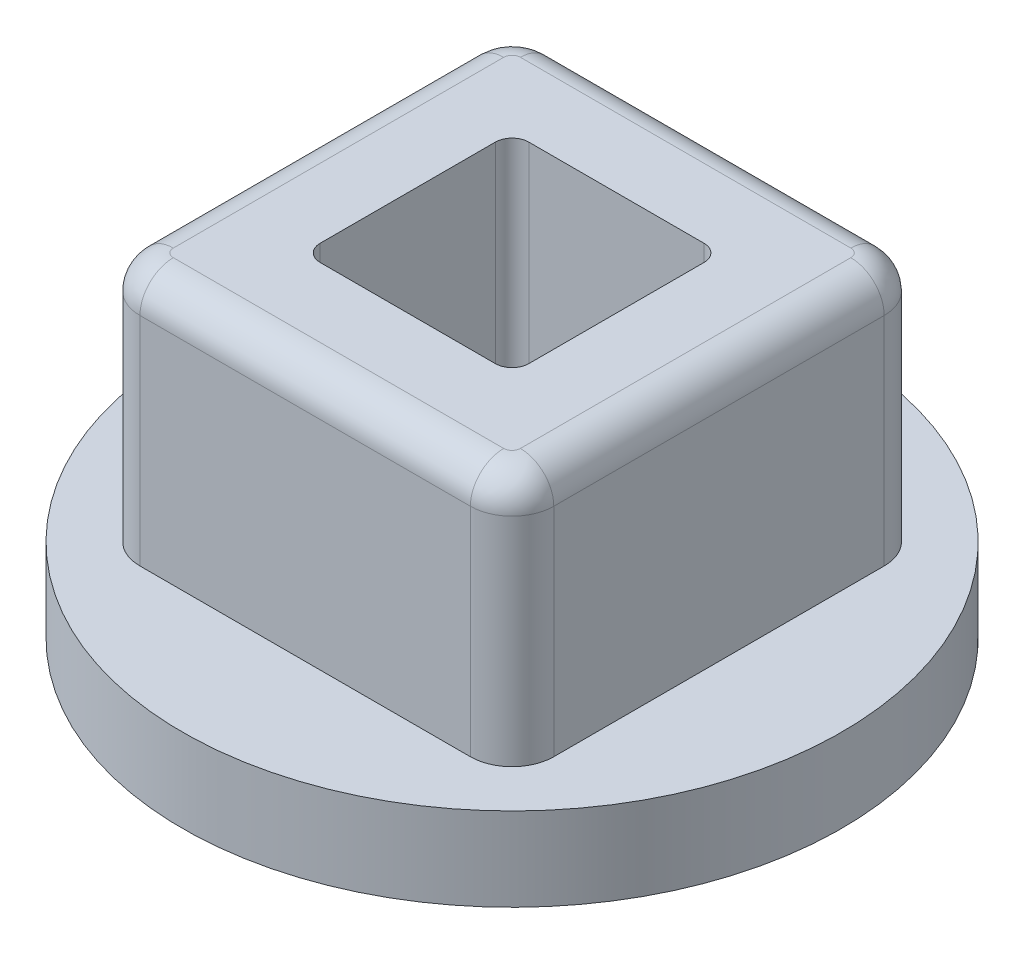
ISO-10303-21;
HEADER;
FILE_DESCRIPTION(('STEP AP214'),'2;1');
FILE_NAME('part.step','',(''),(''),'','','');
FILE_SCHEMA(('AUTOMOTIVE_DESIGN { 1 0 10303 214 1 1 1 1 }'));
ENDSEC;
DATA;
#1=APPLICATION_CONTEXT('core data for automotive mechanical design processes');
#2=APPLICATION_PROTOCOL_DEFINITION('international standard','automotive_design',2000,#1);
#3=PRODUCT_CONTEXT('',#1,'mechanical');
#4=PRODUCT('Part','Part','',(#3));
#5=PRODUCT_RELATED_PRODUCT_CATEGORY('part','',(#4));
#6=PRODUCT_DEFINITION_FORMATION('','',#4);
#7=PRODUCT_DEFINITION_CONTEXT('part definition',#1,'design');
#8=PRODUCT_DEFINITION('design','',#6,#7);
#9=PRODUCT_DEFINITION_SHAPE('','',#8);
#10=(LENGTH_UNIT() NAMED_UNIT(*) SI_UNIT(.MILLI.,.METRE.));
#11=(NAMED_UNIT(*) PLANE_ANGLE_UNIT() SI_UNIT($,.RADIAN.));
#12=(NAMED_UNIT(*) SI_UNIT($,.STERADIAN.) SOLID_ANGLE_UNIT());
#13=UNCERTAINTY_MEASURE_WITH_UNIT(LENGTH_MEASURE(1.E-05),#10,'distance_accuracy_value','');
#14=(GEOMETRIC_REPRESENTATION_CONTEXT(3) GLOBAL_UNCERTAINTY_ASSIGNED_CONTEXT((#13)) GLOBAL_UNIT_ASSIGNED_CONTEXT((#10,
#11,#12)) REPRESENTATION_CONTEXT('',''));
#15=CARTESIAN_POINT('',(0.,0.,0.));
#16=DIRECTION('',(0.,0.,1.));
#17=DIRECTION('',(1.,0.,0.));
#18=AXIS2_PLACEMENT_3D('',#15,#16,#17);
#19=CARTESIAN_POINT('',(-2.5146,5.08,2.5146));
#20=DIRECTION('',(0.,-1.,0.));
#21=DIRECTION('',(0.,0.,-1.));
#22=AXIS2_PLACEMENT_3D('',#19,#20,#21);
#23=CYLINDRICAL_SURFACE('',#22,0.635);
#24=DIRECTION('',(0.,1.,0.));
#25=VECTOR('',#24,1.);
#26=CARTESIAN_POINT('',(-3.1496,5.08,2.51460000000017));
#27=LINE('',#26,#25);
#28=CARTESIAN_POINT('',(-3.14960000000013,4.572,2.5146000000011));
#29=VERTEX_POINT('',#28);
#30=CARTESIAN_POINT('',(-3.1496,1.27,2.51460000000009));
#31=VERTEX_POINT('',#30);
#32=EDGE_CURVE('E96',#29,#31,#27,.F.);
#33=ORIENTED_EDGE('',*,*,#32,.T.);
#34=CARTESIAN_POINT('',(-2.5146,1.27,2.5146));
#35=DIRECTION('',(0.,-1.,0.));
#36=DIRECTION('',(0.,0.,-1.));
#37=AXIS2_PLACEMENT_3D('',#34,#35,#36);
#38=CIRCLE('',#37,0.635);
#39=CARTESIAN_POINT('',(-2.5146,1.27,3.1496));
#40=VERTEX_POINT('',#39);
#41=EDGE_CURVE('E17',#31,#40,#38,.F.);
#42=ORIENTED_EDGE('',*,*,#41,.T.);
#43=DIRECTION('',(0.,1.,0.));
#44=VECTOR('',#43,1.);
#45=CARTESIAN_POINT('',(-2.5146,5.08,3.1496));
#46=LINE('',#45,#44);
#47=CARTESIAN_POINT('',(-2.51460000000036,4.572,3.14959999999985));
#48=VERTEX_POINT('',#47);
#49=EDGE_CURVE('E94',#40,#48,#46,.T.);
#50=ORIENTED_EDGE('',*,*,#49,.T.);
#51=CARTESIAN_POINT('',(-2.51460000000043,4.572,2.51459999999958));
#52=DIRECTION('',(0.,-1.,0.));
#53=DIRECTION('',(0.,0.,-1.));
#54=AXIS2_PLACEMENT_3D('',#51,#52,#53);
#55=CIRCLE('',#54,0.634999999999828);
#56=EDGE_CURVE('E340',#29,#48,#55,.F.);
#57=ORIENTED_EDGE('',*,*,#56,.F.);
#58=EDGE_LOOP('',(#33,#42,#50,#57));
#59=FACE_BOUND('',#58,.T.);
#60=ADVANCED_FACE('F14',(#59),#23,.T.);
#61=CARTESIAN_POINT('',(-2.5146,5.08,-2.5146));
#62=DIRECTION('',(0.,-1.,0.));
#63=DIRECTION('',(0.,0.,-1.));
#64=AXIS2_PLACEMENT_3D('',#61,#62,#63);
#65=CYLINDRICAL_SURFACE('',#64,0.635);
#66=DIRECTION('',(0.,1.,0.));
#67=VECTOR('',#66,1.);
#68=CARTESIAN_POINT('',(-2.51460000000017,5.08,-3.1496));
#69=LINE('',#68,#67);
#70=CARTESIAN_POINT('',(-2.51459999999987,4.572,-3.14960000000006));
#71=VERTEX_POINT('',#70);
#72=CARTESIAN_POINT('',(-2.51460000000009,1.27,-3.1496));
#73=VERTEX_POINT('',#72);
#74=EDGE_CURVE('E241',#71,#73,#69,.F.);
#75=ORIENTED_EDGE('',*,*,#74,.T.);
#76=CARTESIAN_POINT('',(-2.5146,1.27,-2.5146));
#77=DIRECTION('',(0.,-1.,0.));
#78=DIRECTION('',(0.,0.,-1.));
#79=AXIS2_PLACEMENT_3D('',#76,#77,#78);
#80=CIRCLE('',#79,0.635);
#81=CARTESIAN_POINT('',(-3.1496,1.27,-2.5146));
#82=VERTEX_POINT('',#81);
#83=EDGE_CURVE('E98',#73,#82,#80,.F.);
#84=ORIENTED_EDGE('',*,*,#83,.T.);
#85=DIRECTION('',(0.,1.,0.));
#86=VECTOR('',#85,1.);
#87=CARTESIAN_POINT('',(-3.1496,5.08,-2.5146));
#88=LINE('',#87,#86);
#89=CARTESIAN_POINT('',(-3.1495999999997,4.572,-2.5146));
#90=VERTEX_POINT('',#89);
#91=EDGE_CURVE('E248',#82,#90,#88,.T.);
#92=ORIENTED_EDGE('',*,*,#91,.T.);
#93=CARTESIAN_POINT('',(-2.51459999999958,4.572,-2.51460000000043));
#94=DIRECTION('',(0.,-1.,0.));
#95=DIRECTION('',(0.,0.,-1.));
#96=AXIS2_PLACEMENT_3D('',#93,#94,#95);
#97=CIRCLE('',#96,0.634999999999828);
#98=EDGE_CURVE('E255',#71,#90,#97,.F.);
#99=ORIENTED_EDGE('',*,*,#98,.F.);
#100=EDGE_LOOP('',(#75,#84,#92,#99));
#101=FACE_BOUND('',#100,.T.);
#102=ADVANCED_FACE('F401',(#101),#65,.T.);
#103=CARTESIAN_POINT('',(2.5146,5.08,2.5146));
#104=DIRECTION('',(0.,-1.,0.));
#105=DIRECTION('',(0.,0.,-1.));
#106=AXIS2_PLACEMENT_3D('',#103,#104,#105);
#107=CYLINDRICAL_SURFACE('',#106,0.635);
#108=DIRECTION('',(0.,1.,0.));
#109=VECTOR('',#108,1.);
#110=CARTESIAN_POINT('',(2.51460000000009,5.08,3.1496));
#111=LINE('',#110,#109);
#112=CARTESIAN_POINT('',(2.51460000000106,4.572,3.14960000000013));
#113=VERTEX_POINT('',#112);
#114=CARTESIAN_POINT('',(2.51460000000004,1.27,3.1496));
#115=VERTEX_POINT('',#114);
#116=EDGE_CURVE('E251',#113,#115,#111,.F.);
#117=ORIENTED_EDGE('',*,*,#116,.T.);
#118=CARTESIAN_POINT('',(2.5146,1.27,2.5146));
#119=DIRECTION('',(0.,-1.,0.));
#120=DIRECTION('',(0.,0.,-1.));
#121=AXIS2_PLACEMENT_3D('',#118,#119,#120);
#122=CIRCLE('',#121,0.635);
#123=CARTESIAN_POINT('',(3.1496,1.27,2.5146));
#124=VERTEX_POINT('',#123);
#125=EDGE_CURVE('E111',#115,#124,#122,.F.);
#126=ORIENTED_EDGE('',*,*,#125,.T.);
#127=DIRECTION('',(0.,1.,0.));
#128=VECTOR('',#127,1.);
#129=CARTESIAN_POINT('',(3.1496,5.08,2.5146));
#130=LINE('',#129,#128);
#131=CARTESIAN_POINT('',(3.14959999999985,4.572,2.5146));
#132=VERTEX_POINT('',#131);
#133=EDGE_CURVE('E238',#124,#132,#130,.T.);
#134=ORIENTED_EDGE('',*,*,#133,.T.);
#135=CARTESIAN_POINT('',(2.51459999999958,4.572,2.51460000000043));
#136=DIRECTION('',(0.,-1.,0.));
#137=DIRECTION('',(0.,0.,-1.));
#138=AXIS2_PLACEMENT_3D('',#135,#136,#137);
#139=CIRCLE('',#138,0.634999999999828);
#140=EDGE_CURVE('E310',#113,#132,#139,.F.);
#141=ORIENTED_EDGE('',*,*,#140,.F.);
#142=EDGE_LOOP('',(#117,#126,#134,#141));
#143=FACE_BOUND('',#142,.T.);
#144=ADVANCED_FACE('F615',(#143),#107,.T.);
#145=CARTESIAN_POINT('',(2.5146,5.08,-2.5146));
#146=DIRECTION('',(0.,-1.,0.));
#147=DIRECTION('',(0.,0.,-1.));
#148=AXIS2_PLACEMENT_3D('',#145,#146,#147);
#149=CYLINDRICAL_SURFACE('',#148,0.635);
#150=DIRECTION('',(0.,1.,0.));
#151=VECTOR('',#150,1.);
#152=CARTESIAN_POINT('',(3.1496,5.08,-2.51460000000017));
#153=LINE('',#152,#151);
#154=CARTESIAN_POINT('',(3.14960000000013,4.572,-2.5146000000011));
#155=VERTEX_POINT('',#154);
#156=CARTESIAN_POINT('',(3.1496,1.27,-2.51460000000009));
#157=VERTEX_POINT('',#156);
#158=EDGE_CURVE('E233',#155,#157,#153,.F.);
#159=ORIENTED_EDGE('',*,*,#158,.T.);
#160=CARTESIAN_POINT('',(2.5146,1.27,-2.5146));
#161=DIRECTION('',(0.,-1.,0.));
#162=DIRECTION('',(0.,0.,-1.));
#163=AXIS2_PLACEMENT_3D('',#160,#161,#162);
#164=CIRCLE('',#163,0.635);
#165=CARTESIAN_POINT('',(2.5146,1.27,-3.1496));
#166=VERTEX_POINT('',#165);
#167=EDGE_CURVE('E361',#157,#166,#164,.F.);
#168=ORIENTED_EDGE('',*,*,#167,.T.);
#169=DIRECTION('',(0.,1.,0.));
#170=VECTOR('',#169,1.);
#171=CARTESIAN_POINT('',(2.5146,5.08,-3.1496));
#172=LINE('',#171,#170);
#173=CARTESIAN_POINT('',(2.51460000000011,4.572,-3.14959999999985));
#174=VERTEX_POINT('',#173);
#175=EDGE_CURVE('E242',#166,#174,#172,.T.);
#176=ORIENTED_EDGE('',*,*,#175,.T.);
#177=CARTESIAN_POINT('',(2.51460000000043,4.572,-2.51459999999958));
#178=DIRECTION('',(0.,-1.,0.));
#179=DIRECTION('',(0.,0.,-1.));
#180=AXIS2_PLACEMENT_3D('',#177,#178,#179);
#181=CIRCLE('',#180,0.634999999999828);
#182=EDGE_CURVE('E281',#155,#174,#181,.F.);
#183=ORIENTED_EDGE('',*,*,#182,.F.);
#184=EDGE_LOOP('',(#159,#168,#176,#183));
#185=FACE_BOUND('',#184,.T.);
#186=ADVANCED_FACE('F467',(#185),#149,.T.);
#187=CARTESIAN_POINT('',(-2.6416,4.572,2.538898108304));
#188=DIRECTION('',(0.,0.,-1.));
#189=DIRECTION('',(-1.,0.,0.));
#190=AXIS2_PLACEMENT_3D('',#187,#188,#189);
#191=CYLINDRICAL_SURFACE('',#190,0.508);
#192=CARTESIAN_POINT('',(-2.64160000000059,4.57200000000093,2.51460000000007));
#193=DIRECTION('',(-3.86198346587602E-12,0.,-1.));
#194=DIRECTION('',(-1.,0.,3.86198346587602E-12));
#195=AXIS2_PLACEMENT_3D('',#192,#193,#194);
#196=CIRCLE('',#195,0.507999999999662);
#197=CARTESIAN_POINT('',(-2.6415999981047,5.08000000000029,2.51460000000007));
#198=VERTEX_POINT('',#197);
#199=EDGE_CURVE('E200',#198,#29,#196,.F.);
#200=ORIENTED_EDGE('',*,*,#199,.F.);
#201=DIRECTION('',(0.,0.,1.));
#202=VECTOR('',#201,1.);
#203=CARTESIAN_POINT('',(-2.6416,5.08,3.1496));
#204=LINE('',#203,#202);
#205=CARTESIAN_POINT('',(-2.64159999999994,5.08000000000029,-2.51460000000017));
#206=VERTEX_POINT('',#205);
#207=EDGE_CURVE('E186',#206,#198,#204,.T.);
#208=ORIENTED_EDGE('',*,*,#207,.F.);
#209=CARTESIAN_POINT('',(-2.64159999999975,4.57200000000093,-2.51460000000034));
#210=DIRECTION('',(-6.69870225473767E-13,0.,-1.));
#211=DIRECTION('',(-1.,0.,6.69870225473767E-13));
#212=AXIS2_PLACEMENT_3D('',#209,#210,#211);
#213=CIRCLE('',#212,0.507999999999662);
#214=EDGE_CURVE('E107',#90,#206,#213,.T.);
#215=ORIENTED_EDGE('',*,*,#214,.F.);
#216=DIRECTION('',(0.,0.,-1.));
#217=VECTOR('',#216,1.);
#218=CARTESIAN_POINT('',(-3.1496,4.572,-3.1496));
#219=LINE('',#218,#217);
#220=EDGE_CURVE('E247',#90,#29,#219,.F.);
#221=ORIENTED_EDGE('',*,*,#220,.T.);
#222=EDGE_LOOP('',(#200,#208,#215,#221));
#223=FACE_BOUND('',#222,.T.);
#224=ADVANCED_FACE('F197',(#223),#191,.T.);
#225=CARTESIAN_POINT('',(-2.51460000000043,4.57200000000093,2.38759999999941));
#226=DIRECTION('',(1.,0.,0.));
#227=DIRECTION('',(0.,0.,-1.));
#228=AXIS2_PLACEMENT_3D('',#225,#226,#227);
#229=CIRCLE('',#228,0.507999999999662);
#230=TRIMMED_CURVE('',#229,(PARAMETER_VALUE(-1.82347658193748)),
(PARAMETER_VALUE(1.82347658193748)),.T.,.PARAMETER.);
#231=CARTESIAN_POINT('',(-2.51460000000043,4.57200000000093,2.51459999999958));
#232=DIRECTION('',(0.,-1.,0.));
#233=AXIS1_PLACEMENT('',#231,#232);
#234=SURFACE_OF_REVOLUTION('',#230,#233);
#235=CARTESIAN_POINT('',(-2.51460000000014,4.572,2.6416));
#236=DIRECTION('',(-1.,0.,0.));
#237=DIRECTION('',(0.,0.,1.));
#238=AXIS2_PLACEMENT_3D('',#235,#236,#237);
#239=CIRCLE('',#238,0.508);
#240=CARTESIAN_POINT('',(-2.51460000000025,5.08000000000015,2.64159999778818));
#241=VERTEX_POINT('',#240);
#242=EDGE_CURVE('E335',#241,#48,#239,.F.);
#243=ORIENTED_EDGE('',*,*,#242,.F.);
#244=CARTESIAN_POINT('',(-2.51460000000043,5.08000000000059,2.51459999999958));
#245=DIRECTION('',(0.,-1.,0.));
#246=DIRECTION('',(-1.37958325052589E-12,0.,1.));
#247=AXIS2_PLACEMENT_3D('',#244,#245,#246);
#248=CIRCLE('',#247,0.126999998736481);
#249=EDGE_CURVE('E129',#198,#241,#248,.F.);
#250=ORIENTED_EDGE('',*,*,#249,.F.);
#251=ORIENTED_EDGE('',*,*,#199,.T.);
#252=ORIENTED_EDGE('',*,*,#56,.T.);
#253=EDGE_LOOP('',(#243,#250,#251,#252));
#254=FACE_BOUND('',#253,.T.);
#255=ADVANCED_FACE('F346',(#254),#234,.F.);
#256=CARTESIAN_POINT('',(2.538898108304,4.572,2.6416));
#257=DIRECTION('',(-1.,0.,0.));
#258=DIRECTION('',(0.,0.,1.));
#259=AXIS2_PLACEMENT_3D('',#256,#257,#258);
#260=CYLINDRICAL_SURFACE('',#259,0.508);
#261=CARTESIAN_POINT('',(2.51460000000007,4.57200000000093,2.64160000000059));
#262=DIRECTION('',(-1.,0.,3.86902766089366E-12));
#263=DIRECTION('',(3.86902766089366E-12,0.,1.));
#264=AXIS2_PLACEMENT_3D('',#261,#262,#263);
#265=CIRCLE('',#264,0.507999999999662);
#266=CARTESIAN_POINT('',(2.51460000000007,5.08000000000029,2.64159999873631));
#267=VERTEX_POINT('',#266);
#268=EDGE_CURVE('E327',#267,#113,#265,.F.);
#269=ORIENTED_EDGE('',*,*,#268,.F.);
#270=DIRECTION('',(1.,0.,0.));
#271=VECTOR('',#270,1.);
#272=CARTESIAN_POINT('',(-3.1496,5.08,2.64159999747237));
#273=LINE('',#272,#271);
#274=EDGE_CURVE('E203',#241,#267,#273,.T.);
#275=ORIENTED_EDGE('',*,*,#274,.F.);
#276=ORIENTED_EDGE('',*,*,#242,.T.);
#277=DIRECTION('',(-1.,0.,0.));
#278=VECTOR('',#277,1.);
#279=CARTESIAN_POINT('',(-3.1496,4.572,3.1496));
#280=LINE('',#279,#278);
#281=EDGE_CURVE('E106',#48,#113,#280,.F.);
#282=ORIENTED_EDGE('',*,*,#281,.T.);
#283=EDGE_LOOP('',(#269,#275,#276,#282));
#284=FACE_BOUND('',#283,.T.);
#285=ADVANCED_FACE('F321',(#284),#260,.T.);
#286=CARTESIAN_POINT('',(2.51459999999958,4.57200000000093,2.38760000000026));
#287=DIRECTION('',(1.,0.,0.));
#288=DIRECTION('',(0.,0.,-1.));
#289=AXIS2_PLACEMENT_3D('',#286,#287,#288);
#290=CIRCLE('',#289,0.507999999999662);
#291=TRIMMED_CURVE('',#290,(PARAMETER_VALUE(-1.82347658193748)),
(PARAMETER_VALUE(1.82347658193748)),.T.,.PARAMETER.);
#292=CARTESIAN_POINT('',(2.51459999999958,4.57200000000093,2.51460000000043));
#293=DIRECTION('',(0.,-1.,0.));
#294=AXIS1_PLACEMENT('',#292,#293);
#295=SURFACE_OF_REVOLUTION('',#291,#294);
#296=CARTESIAN_POINT('',(2.6416,4.572,2.5146));
#297=DIRECTION('',(0.,0.,1.));
#298=DIRECTION('',(1.,0.,0.));
#299=AXIS2_PLACEMENT_3D('',#296,#297,#298);
#300=CIRCLE('',#299,0.508);
#301=CARTESIAN_POINT('',(2.64159999936797,5.08000000000015,2.51460000000008));
#302=VERTEX_POINT('',#301);
#303=EDGE_CURVE('E305',#302,#132,#300,.F.);
#304=ORIENTED_EDGE('',*,*,#303,.F.);
#305=CARTESIAN_POINT('',(2.51459999999958,5.08000000000059,2.51460000000043));
#306=DIRECTION('',(0.,-1.,0.));
#307=DIRECTION('',(1.,0.,-6.72717568438272E-13));
#308=AXIS2_PLACEMENT_3D('',#305,#306,#307);
#309=CIRCLE('',#308,0.127000000000293);
#310=EDGE_CURVE('E481',#267,#302,#309,.F.);
#311=ORIENTED_EDGE('',*,*,#310,.F.);
#312=ORIENTED_EDGE('',*,*,#268,.T.);
#313=ORIENTED_EDGE('',*,*,#140,.T.);
#314=EDGE_LOOP('',(#304,#311,#312,#313));
#315=FACE_BOUND('',#314,.T.);
#316=ADVANCED_FACE('F317',(#315),#295,.F.);
#317=CARTESIAN_POINT('',(2.6416,4.572,-2.538898108304));
#318=DIRECTION('',(0.,0.,1.));
#319=DIRECTION('',(1.,0.,0.));
#320=AXIS2_PLACEMENT_3D('',#317,#318,#319);
#321=CYLINDRICAL_SURFACE('',#320,0.508);
#322=CARTESIAN_POINT('',(2.64160000000059,4.57200000000093,-2.51460000000007));
#323=DIRECTION('',(3.86563575947983E-12,0.,1.));
#324=DIRECTION('',(1.,0.,-3.86563575947983E-12));
#325=AXIS2_PLACEMENT_3D('',#322,#323,#324);
#326=CIRCLE('',#325,0.507999999999662);
#327=CARTESIAN_POINT('',(2.64159999873636,5.08000000000029,-2.51460000000007));
#328=VERTEX_POINT('',#327);
#329=EDGE_CURVE('E297',#328,#155,#326,.F.);
#330=ORIENTED_EDGE('',*,*,#329,.F.);
#331=DIRECTION('',(0.,0.,1.));
#332=VECTOR('',#331,1.);
#333=CARTESIAN_POINT('',(2.6416,5.08,3.1496));
#334=LINE('',#333,#332);
#335=EDGE_CURVE('E485',#302,#328,#334,.F.);
#336=ORIENTED_EDGE('',*,*,#335,.F.);
#337=ORIENTED_EDGE('',*,*,#303,.T.);
#338=DIRECTION('',(0.,0.,1.));
#339=VECTOR('',#338,1.);
#340=CARTESIAN_POINT('',(3.1496,4.572,-3.1496));
#341=LINE('',#340,#339);
#342=EDGE_CURVE('E237',#132,#155,#341,.F.);
#343=ORIENTED_EDGE('',*,*,#342,.T.);
#344=EDGE_LOOP('',(#330,#336,#337,#343));
#345=FACE_BOUND('',#344,.T.);
#346=ADVANCED_FACE('F291',(#345),#321,.T.);
#347=CARTESIAN_POINT('',(2.51460000000043,4.57200000000093,-2.64159999999975));
#348=DIRECTION('',(1.,0.,0.));
#349=DIRECTION('',(0.,0.,-1.));
#350=AXIS2_PLACEMENT_3D('',#347,#348,#349);
#351=CIRCLE('',#350,0.507999999999662);
#352=TRIMMED_CURVE('',#351,(PARAMETER_VALUE(-1.82347658193748)),
(PARAMETER_VALUE(1.82347658193748)),.T.,.PARAMETER.);
#353=CARTESIAN_POINT('',(2.51460000000043,4.57200000000093,-2.51459999999958));
#354=DIRECTION('',(0.,-1.,0.));
#355=AXIS1_PLACEMENT('',#353,#354);
#356=SURFACE_OF_REVOLUTION('',#352,#355);
#357=CARTESIAN_POINT('',(2.5146,4.572,-2.6416));
#358=DIRECTION('',(1.,0.,0.));
#359=DIRECTION('',(0.,0.,-1.));
#360=AXIS2_PLACEMENT_3D('',#357,#358,#359);
#361=CIRCLE('',#360,0.508);
#362=CARTESIAN_POINT('',(2.51460000000011,5.08000000000015,-2.64159999936809));
#363=VERTEX_POINT('',#362);
#364=EDGE_CURVE('E277',#363,#174,#361,.F.);
#365=ORIENTED_EDGE('',*,*,#364,.F.);
#366=CARTESIAN_POINT('',(2.51460000000043,5.08000000000059,-2.51459999999958));
#367=DIRECTION('',(0.,-1.,0.));
#368=DIRECTION('',(0.,0.,-1.));
#369=AXIS2_PLACEMENT_3D('',#366,#367,#368);
#370=CIRCLE('',#369,0.127000000000293);
#371=EDGE_CURVE('E172',#328,#363,#370,.F.);
#372=ORIENTED_EDGE('',*,*,#371,.F.);
#373=ORIENTED_EDGE('',*,*,#329,.T.);
#374=ORIENTED_EDGE('',*,*,#182,.T.);
#375=EDGE_LOOP('',(#365,#372,#373,#374));
#376=FACE_BOUND('',#375,.T.);
#377=ADVANCED_FACE('F287',(#376),#356,.F.);
#378=CARTESIAN_POINT('',(-2.538898108304,4.572,-2.6416));
#379=DIRECTION('',(1.,0.,0.));
#380=DIRECTION('',(0.,0.,-1.));
#381=AXIS2_PLACEMENT_3D('',#378,#379,#380);
#382=CYLINDRICAL_SURFACE('',#381,0.508);
#383=CARTESIAN_POINT('',(-2.51460000000017,4.572,-2.6416));
#384=DIRECTION('',(1.,0.,0.));
#385=DIRECTION('',(0.,0.,-1.));
#386=AXIS2_PLACEMENT_3D('',#383,#384,#385);
#387=CIRCLE('',#386,0.508);
#388=CARTESIAN_POINT('',(-2.51459999999989,5.08000000000024,-2.64159999797814));
#389=VERTEX_POINT('',#388);
#390=EDGE_CURVE('E280',#389,#71,#387,.F.);
#391=ORIENTED_EDGE('',*,*,#390,.F.);
#392=DIRECTION('',(1.,0.,0.));
#393=VECTOR('',#392,1.);
#394=CARTESIAN_POINT('',(-3.1496,5.08,-2.6416));
#395=LINE('',#394,#393);
#396=EDGE_CURVE('E119',#363,#389,#395,.F.);
#397=ORIENTED_EDGE('',*,*,#396,.F.);
#398=ORIENTED_EDGE('',*,*,#364,.T.);
#399=DIRECTION('',(1.,0.,0.));
#400=VECTOR('',#399,1.);
#401=CARTESIAN_POINT('',(-3.1496,4.572,-3.1496));
#402=LINE('',#401,#400);
#403=EDGE_CURVE('E245',#174,#71,#402,.F.);
#404=ORIENTED_EDGE('',*,*,#403,.T.);
#405=EDGE_LOOP('',(#391,#397,#398,#404));
#406=FACE_BOUND('',#405,.T.);
#407=ADVANCED_FACE('F262',(#406),#382,.T.);
#408=CARTESIAN_POINT('',(-2.51459999999958,4.57200000000093,-2.64160000000059));
#409=DIRECTION('',(1.,0.,0.));
#410=DIRECTION('',(0.,0.,-1.));
#411=AXIS2_PLACEMENT_3D('',#408,#409,#410);
#412=CIRCLE('',#411,0.507999999999662);
#413=TRIMMED_CURVE('',#412,(PARAMETER_VALUE(-1.82347658193748)),
(PARAMETER_VALUE(1.82347658193748)),.T.,.PARAMETER.);
#414=CARTESIAN_POINT('',(-2.51459999999958,4.57200000000093,-2.51460000000043));
#415=DIRECTION('',(0.,-1.,0.));
#416=AXIS1_PLACEMENT('',#414,#415);
#417=SURFACE_OF_REVOLUTION('',#413,#416);
#418=ORIENTED_EDGE('',*,*,#214,.T.);
#419=CARTESIAN_POINT('',(-2.51459999999958,5.08000000000059,-2.51460000000043));
#420=DIRECTION('',(0.,-1.,0.));
#421=DIRECTION('',(-1.,0.,6.72717568438272E-13));
#422=AXIS2_PLACEMENT_3D('',#419,#420,#421);
#423=CIRCLE('',#422,0.127000000000293);
#424=EDGE_CURVE('E114',#389,#206,#423,.F.);
#425=ORIENTED_EDGE('',*,*,#424,.F.);
#426=ORIENTED_EDGE('',*,*,#390,.T.);
#427=ORIENTED_EDGE('',*,*,#98,.T.);
#428=EDGE_LOOP('',(#418,#425,#426,#427));
#429=FACE_BOUND('',#428,.T.);
#430=ADVANCED_FACE('F257',(#429),#417,.F.);
#431=CARTESIAN_POINT('',(-3.1496,5.08,3.1496));
#432=DIRECTION('',(0.,0.,-1.));
#433=DIRECTION('',(-1.,0.,0.));
#434=AXIS2_PLACEMENT_3D('',#431,#432,#433);
#435=PLANE('',#434);
#436=ORIENTED_EDGE('',*,*,#116,.F.);
#437=ORIENTED_EDGE('',*,*,#281,.F.);
#438=ORIENTED_EDGE('',*,*,#49,.F.);
#439=DIRECTION('',(1.,0.,0.));
#440=VECTOR('',#439,1.);
#441=CARTESIAN_POINT('',(0.,1.27,3.1496));
#442=LINE('',#441,#440);
#443=EDGE_CURVE('E104',#115,#40,#442,.F.);
#444=ORIENTED_EDGE('',*,*,#443,.F.);
#445=EDGE_LOOP('',(#436,#437,#438,#444));
#446=FACE_BOUND('',#445,.T.);
#447=ADVANCED_FACE('F103',(#446),#435,.F.);
#448=CARTESIAN_POINT('',(-3.1496,5.08,-3.1496));
#449=DIRECTION('',(1.,0.,0.));
#450=DIRECTION('',(0.,0.,-1.));
#451=AXIS2_PLACEMENT_3D('',#448,#449,#450);
#452=PLANE('',#451);
#453=ORIENTED_EDGE('',*,*,#32,.F.);
#454=ORIENTED_EDGE('',*,*,#220,.F.);
#455=ORIENTED_EDGE('',*,*,#91,.F.);
#456=DIRECTION('',(0.,0.,1.));
#457=VECTOR('',#456,1.);
#458=CARTESIAN_POINT('',(-3.1496,1.27,0.));
#459=LINE('',#458,#457);
#460=EDGE_CURVE('E113',#31,#82,#459,.F.);
#461=ORIENTED_EDGE('',*,*,#460,.F.);
#462=EDGE_LOOP('',(#453,#454,#455,#461));
#463=FACE_BOUND('',#462,.T.);
#464=ADVANCED_FACE('F408',(#463),#452,.F.);
#465=CARTESIAN_POINT('',(-3.1496,5.08,-3.1496));
#466=DIRECTION('',(0.,0.,1.));
#467=DIRECTION('',(1.,0.,0.));
#468=AXIS2_PLACEMENT_3D('',#465,#466,#467);
#469=PLANE('',#468);
#470=ORIENTED_EDGE('',*,*,#74,.F.);
#471=ORIENTED_EDGE('',*,*,#403,.F.);
#472=ORIENTED_EDGE('',*,*,#175,.F.);
#473=DIRECTION('',(1.,0.,0.));
#474=VECTOR('',#473,1.);
#475=CARTESIAN_POINT('',(0.,1.27,-3.1496));
#476=LINE('',#475,#474);
#477=EDGE_CURVE('E116',#73,#166,#476,.T.);
#478=ORIENTED_EDGE('',*,*,#477,.F.);
#479=EDGE_LOOP('',(#470,#471,#472,#478));
#480=FACE_BOUND('',#479,.T.);
#481=ADVANCED_FACE('F462',(#480),#469,.F.);
#482=CARTESIAN_POINT('',(3.1496,5.08,-3.1496));
#483=DIRECTION('',(-1.,0.,0.));
#484=DIRECTION('',(0.,0.,1.));
#485=AXIS2_PLACEMENT_3D('',#482,#483,#484);
#486=PLANE('',#485);
#487=ORIENTED_EDGE('',*,*,#158,.F.);
#488=ORIENTED_EDGE('',*,*,#342,.F.);
#489=ORIENTED_EDGE('',*,*,#133,.F.);
#490=DIRECTION('',(0.,0.,1.));
#491=VECTOR('',#490,1.);
#492=CARTESIAN_POINT('',(3.1496,1.27,0.));
#493=LINE('',#492,#491);
#494=EDGE_CURVE('E457',#157,#124,#493,.T.);
#495=ORIENTED_EDGE('',*,*,#494,.F.);
#496=EDGE_LOOP('',(#487,#488,#489,#495));
#497=FACE_BOUND('',#496,.T.);
#498=ADVANCED_FACE('F553',(#497),#486,.F.);
#499=CARTESIAN_POINT('',(1.3335,5.08,-1.3335));
#500=DIRECTION('',(0.,1.,0.));
#501=DIRECTION('',(0.,0.,1.));
#502=AXIS2_PLACEMENT_3D('',#499,#500,#501);
#503=CYLINDRICAL_SURFACE('',#502,0.254);
#504=DIRECTION('',(0.,1.,0.));
#505=VECTOR('',#504,1.);
#506=CARTESIAN_POINT('',(1.5875,5.08,-1.3335));
#507=LINE('',#506,#505);
#508=CARTESIAN_POINT('',(1.5875,0.,-1.3335));
#509=VERTEX_POINT('',#508);
#510=CARTESIAN_POINT('',(1.5875,5.08,-1.3335));
#511=VERTEX_POINT('',#510);
#512=EDGE_CURVE('E227',#509,#511,#507,.T.);
#513=ORIENTED_EDGE('',*,*,#512,.T.);
#514=CARTESIAN_POINT('',(1.3335,5.08,-1.3335));
#515=DIRECTION('',(0.,1.,0.));
#516=DIRECTION('',(0.,0.,1.));
#517=AXIS2_PLACEMENT_3D('',#514,#515,#516);
#518=CIRCLE('',#517,0.254);
#519=CARTESIAN_POINT('',(1.3335,5.08,-1.5875));
#520=VERTEX_POINT('',#519);
#521=EDGE_CURVE('E201',#520,#511,#518,.F.);
#522=ORIENTED_EDGE('',*,*,#521,.F.);
#523=DIRECTION('',(0.,1.,0.));
#524=VECTOR('',#523,1.);
#525=CARTESIAN_POINT('',(1.3335,5.08,-1.5875));
#526=LINE('',#525,#524);
#527=CARTESIAN_POINT('',(1.3335,0.,-1.5875));
#528=VERTEX_POINT('',#527);
#529=EDGE_CURVE('E231',#520,#528,#526,.F.);
#530=ORIENTED_EDGE('',*,*,#529,.T.);
#531=CARTESIAN_POINT('',(1.3335,0.,-1.3335));
#532=DIRECTION('',(0.,1.,0.));
#533=DIRECTION('',(0.,0.,1.));
#534=AXIS2_PLACEMENT_3D('',#531,#532,#533);
#535=CIRCLE('',#534,0.254);
#536=EDGE_CURVE('E236',#509,#528,#535,.T.);
#537=ORIENTED_EDGE('',*,*,#536,.F.);
#538=EDGE_LOOP('',(#513,#522,#530,#537));
#539=FACE_BOUND('',#538,.T.);
#540=ADVANCED_FACE('F551',(#539),#503,.F.);
#541=CARTESIAN_POINT('',(1.3335,5.08,1.3335));
#542=DIRECTION('',(0.,1.,0.));
#543=DIRECTION('',(0.,0.,1.));
#544=AXIS2_PLACEMENT_3D('',#541,#542,#543);
#545=CYLINDRICAL_SURFACE('',#544,0.254);
#546=DIRECTION('',(0.,1.,0.));
#547=VECTOR('',#546,1.);
#548=CARTESIAN_POINT('',(1.3335,5.08,1.5875));
#549=LINE('',#548,#547);
#550=CARTESIAN_POINT('',(1.3335,0.,1.5875));
#551=VERTEX_POINT('',#550);
#552=CARTESIAN_POINT('',(1.3335,5.08,1.5875));
#553=VERTEX_POINT('',#552);
#554=EDGE_CURVE('E222',#551,#553,#549,.T.);
#555=ORIENTED_EDGE('',*,*,#554,.T.);
#556=CARTESIAN_POINT('',(1.3335,5.08,1.3335));
#557=DIRECTION('',(0.,1.,0.));
#558=DIRECTION('',(0.,0.,1.));
#559=AXIS2_PLACEMENT_3D('',#556,#557,#558);
#560=CIRCLE('',#559,0.254);
#561=CARTESIAN_POINT('',(1.5875,5.08,1.3335));
#562=VERTEX_POINT('',#561);
#563=EDGE_CURVE('E384',#562,#553,#560,.F.);
#564=ORIENTED_EDGE('',*,*,#563,.F.);
#565=DIRECTION('',(0.,1.,0.));
#566=VECTOR('',#565,1.);
#567=CARTESIAN_POINT('',(1.5875,5.08,1.3335));
#568=LINE('',#567,#566);
#569=CARTESIAN_POINT('',(1.5875,0.,1.3335));
#570=VERTEX_POINT('',#569);
#571=EDGE_CURVE('E226',#562,#570,#568,.F.);
#572=ORIENTED_EDGE('',*,*,#571,.T.);
#573=CARTESIAN_POINT('',(1.3335,0.,1.3335));
#574=DIRECTION('',(0.,1.,0.));
#575=DIRECTION('',(0.,0.,1.));
#576=AXIS2_PLACEMENT_3D('',#573,#574,#575);
#577=CIRCLE('',#576,0.254);
#578=EDGE_CURVE('E390',#551,#570,#577,.T.);
#579=ORIENTED_EDGE('',*,*,#578,.F.);
#580=EDGE_LOOP('',(#555,#564,#572,#579));
#581=FACE_BOUND('',#580,.T.);
#582=ADVANCED_FACE('F445',(#581),#545,.F.);
#583=CARTESIAN_POINT('',(-1.3335,5.08,-1.3335));
#584=DIRECTION('',(0.,1.,0.));
#585=DIRECTION('',(0.,0.,1.));
#586=AXIS2_PLACEMENT_3D('',#583,#584,#585);
#587=CYLINDRICAL_SURFACE('',#586,0.254);
#588=DIRECTION('',(0.,1.,0.));
#589=VECTOR('',#588,1.);
#590=CARTESIAN_POINT('',(-1.3335,5.08,-1.5875));
#591=LINE('',#590,#589);
#592=CARTESIAN_POINT('',(-1.3335,0.,-1.5875));
#593=VERTEX_POINT('',#592);
#594=CARTESIAN_POINT('',(-1.3335,5.08,-1.5875));
#595=VERTEX_POINT('',#594);
#596=EDGE_CURVE('E232',#593,#595,#591,.T.);
#597=ORIENTED_EDGE('',*,*,#596,.T.);
#598=CARTESIAN_POINT('',(-1.3335,5.08,-1.3335));
#599=DIRECTION('',(0.,1.,0.));
#600=DIRECTION('',(0.,0.,1.));
#601=AXIS2_PLACEMENT_3D('',#598,#599,#600);
#602=CIRCLE('',#601,0.254);
#603=CARTESIAN_POINT('',(-1.5875,5.08,-1.3335));
#604=VERTEX_POINT('',#603);
#605=EDGE_CURVE('E205',#604,#595,#602,.F.);
#606=ORIENTED_EDGE('',*,*,#605,.F.);
#607=DIRECTION('',(0.,1.,0.));
#608=VECTOR('',#607,1.);
#609=CARTESIAN_POINT('',(-1.5875,5.08,-1.3335));
#610=LINE('',#609,#608);
#611=CARTESIAN_POINT('',(-1.5875,0.,-1.3335));
#612=VERTEX_POINT('',#611);
#613=EDGE_CURVE('E450',#604,#612,#610,.F.);
#614=ORIENTED_EDGE('',*,*,#613,.T.);
#615=CARTESIAN_POINT('',(-1.3335,0.,-1.3335));
#616=DIRECTION('',(0.,1.,0.));
#617=DIRECTION('',(0.,0.,1.));
#618=AXIS2_PLACEMENT_3D('',#615,#616,#617);
#619=CIRCLE('',#618,0.254);
#620=EDGE_CURVE('E388',#593,#612,#619,.T.);
#621=ORIENTED_EDGE('',*,*,#620,.F.);
#622=EDGE_LOOP('',(#597,#606,#614,#621));
#623=FACE_BOUND('',#622,.T.);
#624=ADVANCED_FACE('F539',(#623),#587,.F.);
#625=CARTESIAN_POINT('',(-1.3335,5.08,1.3335));
#626=DIRECTION('',(0.,1.,0.));
#627=DIRECTION('',(0.,0.,1.));
#628=AXIS2_PLACEMENT_3D('',#625,#626,#627);
#629=CYLINDRICAL_SURFACE('',#628,0.254);
#630=DIRECTION('',(0.,1.,0.));
#631=VECTOR('',#630,1.);
#632=CARTESIAN_POINT('',(-1.5875,5.08,1.3335));
#633=LINE('',#632,#631);
#634=CARTESIAN_POINT('',(-1.5875,0.,1.3335));
#635=VERTEX_POINT('',#634);
#636=CARTESIAN_POINT('',(-1.5875,5.08,1.3335));
#637=VERTEX_POINT('',#636);
#638=EDGE_CURVE('E217',#635,#637,#633,.T.);
#639=ORIENTED_EDGE('',*,*,#638,.T.);
#640=CARTESIAN_POINT('',(-1.3335,5.08,1.3335));
#641=DIRECTION('',(0.,1.,0.));
#642=DIRECTION('',(0.,0.,1.));
#643=AXIS2_PLACEMENT_3D('',#640,#641,#642);
#644=CIRCLE('',#643,0.254);
#645=CARTESIAN_POINT('',(-1.3335,5.08,1.5875));
#646=VERTEX_POINT('',#645);
#647=EDGE_CURVE('E381',#646,#637,#644,.F.);
#648=ORIENTED_EDGE('',*,*,#647,.F.);
#649=DIRECTION('',(0.,1.,0.));
#650=VECTOR('',#649,1.);
#651=CARTESIAN_POINT('',(-1.3335,5.08,1.5875));
#652=LINE('',#651,#650);
#653=CARTESIAN_POINT('',(-1.3335,0.,1.5875));
#654=VERTEX_POINT('',#653);
#655=EDGE_CURVE('E221',#646,#654,#652,.F.);
#656=ORIENTED_EDGE('',*,*,#655,.T.);
#657=CARTESIAN_POINT('',(-1.3335,0.,1.3335));
#658=DIRECTION('',(0.,1.,0.));
#659=DIRECTION('',(0.,0.,1.));
#660=AXIS2_PLACEMENT_3D('',#657,#658,#659);
#661=CIRCLE('',#660,0.254);
#662=EDGE_CURVE('E32',#635,#654,#661,.T.);
#663=ORIENTED_EDGE('',*,*,#662,.F.);
#664=EDGE_LOOP('',(#639,#648,#656,#663));
#665=FACE_BOUND('',#664,.T.);
#666=ADVANCED_FACE('F147',(#665),#629,.F.);
#667=CARTESIAN_POINT('',(-3.1496,5.08,3.1496));
#668=DIRECTION('',(0.,1.,0.));
#669=DIRECTION('',(0.,0.,1.));
#670=AXIS2_PLACEMENT_3D('',#667,#668,#669);
#671=PLANE('',#670);
#672=ORIENTED_EDGE('',*,*,#396,.T.);
#673=ORIENTED_EDGE('',*,*,#424,.T.);
#674=ORIENTED_EDGE('',*,*,#207,.T.);
#675=ORIENTED_EDGE('',*,*,#249,.T.);
#676=ORIENTED_EDGE('',*,*,#274,.T.);
#677=ORIENTED_EDGE('',*,*,#310,.T.);
#678=ORIENTED_EDGE('',*,*,#335,.T.);
#679=ORIENTED_EDGE('',*,*,#371,.T.);
#680=EDGE_LOOP('',(#672,#673,#674,#675,#676,#677,#678,#679));
#681=FACE_BOUND('',#680,.T.);
#682=ORIENTED_EDGE('',*,*,#521,.T.);
#683=DIRECTION('',(0.,0.,-1.));
#684=VECTOR('',#683,1.);
#685=CARTESIAN_POINT('',(1.5875,5.08,1.5875));
#686=LINE('',#685,#684);
#687=EDGE_CURVE('E223',#511,#562,#686,.F.);
#688=ORIENTED_EDGE('',*,*,#687,.T.);
#689=ORIENTED_EDGE('',*,*,#563,.T.);
#690=DIRECTION('',(1.,0.,0.));
#691=VECTOR('',#690,1.);
#692=CARTESIAN_POINT('',(-1.5875,5.08,1.5875));
#693=LINE('',#692,#691);
#694=EDGE_CURVE('E218',#553,#646,#693,.F.);
#695=ORIENTED_EDGE('',*,*,#694,.T.);
#696=ORIENTED_EDGE('',*,*,#647,.T.);
#697=DIRECTION('',(0.,0.,1.));
#698=VECTOR('',#697,1.);
#699=CARTESIAN_POINT('',(-1.5875,5.08,1.5875));
#700=LINE('',#699,#698);
#701=EDGE_CURVE('E213',#637,#604,#700,.F.);
#702=ORIENTED_EDGE('',*,*,#701,.T.);
#703=ORIENTED_EDGE('',*,*,#605,.T.);
#704=DIRECTION('',(-1.,0.,0.));
#705=VECTOR('',#704,1.);
#706=CARTESIAN_POINT('',(-1.5875,5.08,-1.5875));
#707=LINE('',#706,#705);
#708=EDGE_CURVE('E228',#595,#520,#707,.F.);
#709=ORIENTED_EDGE('',*,*,#708,.T.);
#710=EDGE_LOOP('',(#682,#688,#689,#695,#696,#702,#703,#709));
#711=FACE_BOUND('',#710,.T.);
#712=ADVANCED_FACE('F137',(#681,#711),#671,.T.);
#713=CARTESIAN_POINT('',(0.,1.27,0.));
#714=DIRECTION('',(0.,1.,0.));
#715=DIRECTION('',(0.,0.,1.));
#716=AXIS2_PLACEMENT_3D('',#713,#714,#715);
#717=PLANE('',#716);
#718=CARTESIAN_POINT('',(0.,1.27,0.));
#719=DIRECTION('',(0.,-1.,0.));
#720=DIRECTION('',(0.,0.,-1.));
#721=AXIS2_PLACEMENT_3D('',#718,#719,#720);
#722=CIRCLE('',#721,5.0165);
#723=CARTESIAN_POINT('',(0.,1.27,-5.0165));
#724=VERTEX_POINT('',#723);
#725=EDGE_CURVE('E216',#724,#724,#722,.T.);
#726=ORIENTED_EDGE('',*,*,#725,.F.);
#727=EDGE_LOOP('',(#726));
#728=FACE_BOUND('',#727,.T.);
#729=ORIENTED_EDGE('',*,*,#167,.F.);
#730=ORIENTED_EDGE('',*,*,#494,.T.);
#731=ORIENTED_EDGE('',*,*,#125,.F.);
#732=ORIENTED_EDGE('',*,*,#443,.T.);
#733=ORIENTED_EDGE('',*,*,#41,.F.);
#734=ORIENTED_EDGE('',*,*,#460,.T.);
#735=ORIENTED_EDGE('',*,*,#83,.F.);
#736=ORIENTED_EDGE('',*,*,#477,.T.);
#737=EDGE_LOOP('',(#729,#730,#731,#732,#733,#734,#735,#736));
#738=FACE_BOUND('',#737,.T.);
#739=ADVANCED_FACE('F109',(#728,#738),#717,.T.);
#740=CARTESIAN_POINT('',(-1.5875,5.08,-1.5875));
#741=DIRECTION('',(0.,0.,-1.));
#742=DIRECTION('',(-1.,0.,0.));
#743=AXIS2_PLACEMENT_3D('',#740,#741,#742);
#744=PLANE('',#743);
#745=ORIENTED_EDGE('',*,*,#529,.F.);
#746=ORIENTED_EDGE('',*,*,#708,.F.);
#747=ORIENTED_EDGE('',*,*,#596,.F.);
#748=DIRECTION('',(1.,0.,0.));
#749=VECTOR('',#748,1.);
#750=CARTESIAN_POINT('',(0.,0.,-1.5875));
#751=LINE('',#750,#749);
#752=EDGE_CURVE('E377',#593,#528,#751,.T.);
#753=ORIENTED_EDGE('',*,*,#752,.T.);
#754=EDGE_LOOP('',(#745,#746,#747,#753));
#755=FACE_BOUND('',#754,.T.);
#756=ADVANCED_FACE('F521',(#755),#744,.F.);
#757=CARTESIAN_POINT('',(1.5875,5.08,1.5875));
#758=DIRECTION('',(1.,0.,0.));
#759=DIRECTION('',(0.,0.,-1.));
#760=AXIS2_PLACEMENT_3D('',#757,#758,#759);
#761=PLANE('',#760);
#762=ORIENTED_EDGE('',*,*,#571,.F.);
#763=ORIENTED_EDGE('',*,*,#687,.F.);
#764=ORIENTED_EDGE('',*,*,#512,.F.);
#765=DIRECTION('',(0.,0.,1.));
#766=VECTOR('',#765,1.);
#767=CARTESIAN_POINT('',(1.5875,0.,0.));
#768=LINE('',#767,#766);
#769=EDGE_CURVE('E543',#509,#570,#768,.T.);
#770=ORIENTED_EDGE('',*,*,#769,.T.);
#771=EDGE_LOOP('',(#762,#763,#764,#770));
#772=FACE_BOUND('',#771,.T.);
#773=ADVANCED_FACE('F519',(#772),#761,.F.);
#774=CARTESIAN_POINT('',(-1.5875,5.08,1.5875));
#775=DIRECTION('',(0.,0.,1.));
#776=DIRECTION('',(1.,0.,0.));
#777=AXIS2_PLACEMENT_3D('',#774,#775,#776);
#778=PLANE('',#777);
#779=ORIENTED_EDGE('',*,*,#655,.F.);
#780=ORIENTED_EDGE('',*,*,#694,.F.);
#781=ORIENTED_EDGE('',*,*,#554,.F.);
#782=DIRECTION('',(1.,0.,0.));
#783=VECTOR('',#782,1.);
#784=CARTESIAN_POINT('',(0.,0.,1.5875));
#785=LINE('',#784,#783);
#786=EDGE_CURVE('E546',#551,#654,#785,.F.);
#787=ORIENTED_EDGE('',*,*,#786,.T.);
#788=EDGE_LOOP('',(#779,#780,#781,#787));
#789=FACE_BOUND('',#788,.T.);
#790=ADVANCED_FACE('F442',(#789),#778,.F.);
#791=CARTESIAN_POINT('',(-1.5875,5.08,1.5875));
#792=DIRECTION('',(-1.,0.,0.));
#793=DIRECTION('',(0.,0.,1.));
#794=AXIS2_PLACEMENT_3D('',#791,#792,#793);
#795=PLANE('',#794);
#796=ORIENTED_EDGE('',*,*,#638,.F.);
#797=DIRECTION('',(0.,0.,1.));
#798=VECTOR('',#797,1.);
#799=CARTESIAN_POINT('',(-1.5875,0.,0.));
#800=LINE('',#799,#798);
#801=EDGE_CURVE('E23',#635,#612,#800,.F.);
#802=ORIENTED_EDGE('',*,*,#801,.T.);
#803=ORIENTED_EDGE('',*,*,#613,.F.);
#804=ORIENTED_EDGE('',*,*,#701,.F.);
#805=EDGE_LOOP('',(#796,#802,#803,#804));
#806=FACE_BOUND('',#805,.T.);
#807=ADVANCED_FACE('F508',(#806),#795,.F.);
#808=CARTESIAN_POINT('',(0.,1.27,0.));
#809=DIRECTION('',(0.,-1.,0.));
#810=DIRECTION('',(0.,0.,-1.));
#811=AXIS2_PLACEMENT_3D('',#808,#809,#810);
#812=CYLINDRICAL_SURFACE('',#811,5.0165);
#813=ORIENTED_EDGE('',*,*,#725,.T.);
#814=EDGE_LOOP('',(#813));
#815=FACE_BOUND('',#814,.T.);
#816=CARTESIAN_POINT('',(0.,0.,0.));
#817=DIRECTION('',(0.,-1.,0.));
#818=DIRECTION('',(0.,0.,-1.));
#819=AXIS2_PLACEMENT_3D('',#816,#817,#818);
#820=CIRCLE('',#819,5.0165);
#821=CARTESIAN_POINT('',(0.,0.,-5.0165));
#822=VERTEX_POINT('',#821);
#823=EDGE_CURVE('E9',#822,#822,#820,.F.);
#824=ORIENTED_EDGE('',*,*,#823,.T.);
#825=EDGE_LOOP('',(#824));
#826=FACE_BOUND('',#825,.T.);
#827=ADVANCED_FACE('F502',(#815,#826),#812,.T.);
#828=CARTESIAN_POINT('',(0.,0.,0.));
#829=DIRECTION('',(0.,1.,0.));
#830=DIRECTION('',(0.,0.,1.));
#831=AXIS2_PLACEMENT_3D('',#828,#829,#830);
#832=PLANE('',#831);
#833=ORIENTED_EDGE('',*,*,#823,.F.);
#834=EDGE_LOOP('',(#833));
#835=FACE_BOUND('',#834,.T.);
#836=ORIENTED_EDGE('',*,*,#662,.T.);
#837=ORIENTED_EDGE('',*,*,#786,.F.);
#838=ORIENTED_EDGE('',*,*,#578,.T.);
#839=ORIENTED_EDGE('',*,*,#769,.F.);
#840=ORIENTED_EDGE('',*,*,#536,.T.);
#841=ORIENTED_EDGE('',*,*,#752,.F.);
#842=ORIENTED_EDGE('',*,*,#620,.T.);
#843=ORIENTED_EDGE('',*,*,#801,.F.);
#844=EDGE_LOOP('',(#836,#837,#838,#839,#840,#841,#842,#843));
#845=FACE_BOUND('',#844,.T.);
#846=ADVANCED_FACE('F500',(#835,#845),#832,.F.);
#847=CLOSED_SHELL('',(#60,#102,#144,#186,#224,#255,#285,#316,#346,#377,#407,#430,#447,#464,#481,
#498,#540,#582,#624,#666,#712,#739,#756,#773,#790,#807,#827,#846));
#848=MANIFOLD_SOLID_BREP('B1',#847);
#849=ADVANCED_BREP_SHAPE_REPRESENTATION('',(#18,#848),#14);
#850=SHAPE_DEFINITION_REPRESENTATION(#9,#849);
ENDSEC;
END-ISO-10303-21;
